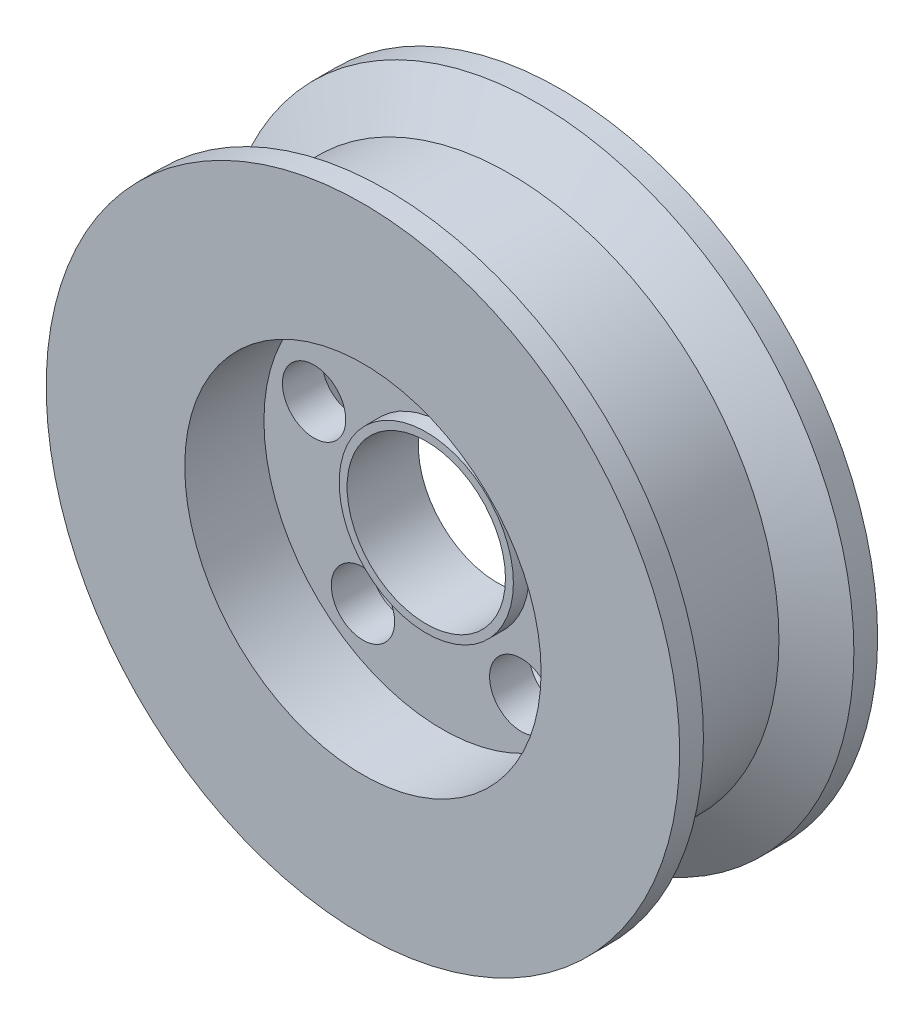
ISO-10303-21;
HEADER;
FILE_DESCRIPTION(('STEP AP214'),'2;1');
FILE_NAME('part.step','',(''),(''),'','','');
FILE_SCHEMA(('AUTOMOTIVE_DESIGN { 1 0 10303 214 1 1 1 1 }'));
ENDSEC;
DATA;
#1=APPLICATION_CONTEXT('core data for automotive mechanical design processes');
#2=APPLICATION_PROTOCOL_DEFINITION('international standard','automotive_design',2000,#1);
#3=PRODUCT_CONTEXT('',#1,'mechanical');
#4=PRODUCT('Part','Part','',(#3));
#5=PRODUCT_RELATED_PRODUCT_CATEGORY('part','',(#4));
#6=PRODUCT_DEFINITION_FORMATION('','',#4);
#7=PRODUCT_DEFINITION_CONTEXT('part definition',#1,'design');
#8=PRODUCT_DEFINITION('design','',#6,#7);
#9=PRODUCT_DEFINITION_SHAPE('','',#8);
#10=(LENGTH_UNIT() NAMED_UNIT(*) SI_UNIT(.MILLI.,.METRE.));
#11=(NAMED_UNIT(*) PLANE_ANGLE_UNIT() SI_UNIT($,.RADIAN.));
#12=(NAMED_UNIT(*) SI_UNIT($,.STERADIAN.) SOLID_ANGLE_UNIT());
#13=UNCERTAINTY_MEASURE_WITH_UNIT(LENGTH_MEASURE(1.E-05),#10,'distance_accuracy_value','');
#14=(GEOMETRIC_REPRESENTATION_CONTEXT(3) GLOBAL_UNCERTAINTY_ASSIGNED_CONTEXT((#13)) GLOBAL_UNIT_ASSIGNED_CONTEXT((#10,
#11,#12)) REPRESENTATION_CONTEXT('',''));
#15=CARTESIAN_POINT('',(0.,0.,0.));
#16=DIRECTION('',(0.,0.,1.));
#17=DIRECTION('',(1.,0.,0.));
#18=AXIS2_PLACEMENT_3D('',#15,#16,#17);
#19=CARTESIAN_POINT('',(0.,0.,12.5));
#20=DIRECTION('',(0.,0.,-1.));
#21=DIRECTION('',(-1.,0.,0.));
#22=AXIS2_PLACEMENT_3D('',#19,#20,#21);
#23=CYLINDRICAL_SURFACE('',#22,40.);
#24=CARTESIAN_POINT('',(0.,0.,-12.5));
#25=DIRECTION('',(0.,0.,1.));
#26=DIRECTION('',(1.,0.,0.));
#27=AXIS2_PLACEMENT_3D('',#24,#25,#26);
#28=CIRCLE('',#27,40.);
#29=CARTESIAN_POINT('',(40.,0.,-12.5));
#30=VERTEX_POINT('',#29);
#31=EDGE_CURVE('E75',#30,#30,#28,.T.);
#32=ORIENTED_EDGE('',*,*,#31,.T.);
#33=EDGE_LOOP('',(#32));
#34=FACE_BOUND('',#33,.T.);
#35=CARTESIAN_POINT('',(0.,0.,-9.5));
#36=DIRECTION('',(0.,0.,1.));
#37=DIRECTION('',(1.,0.,0.));
#38=AXIS2_PLACEMENT_3D('',#35,#36,#37);
#39=CIRCLE('',#38,40.);
#40=CARTESIAN_POINT('',(40.,0.,-9.5));
#41=VERTEX_POINT('',#40);
#42=EDGE_CURVE('E132',#41,#41,#39,.T.);
#43=ORIENTED_EDGE('',*,*,#42,.F.);
#44=EDGE_LOOP('',(#43));
#45=FACE_BOUND('',#44,.T.);
#46=ADVANCED_FACE('F31',(#34,#45),#23,.T.);
#47=CARTESIAN_POINT('',(0.,0.,12.5));
#48=DIRECTION('',(0.,0.,1.));
#49=DIRECTION('',(1.,0.,0.));
#50=AXIS2_PLACEMENT_3D('',#47,#48,#49);
#51=CIRCLE('',#50,40.);
#52=CARTESIAN_POINT('',(40.,0.,12.5));
#53=VERTEX_POINT('',#52);
#54=EDGE_CURVE('E42',#53,#53,#51,.T.);
#55=ORIENTED_EDGE('',*,*,#54,.F.);
#56=EDGE_LOOP('',(#55));
#57=FACE_BOUND('',#56,.T.);
#58=CARTESIAN_POINT('',(0.,0.,9.5));
#59=DIRECTION('',(0.,0.,1.));
#60=DIRECTION('',(1.,0.,0.));
#61=AXIS2_PLACEMENT_3D('',#58,#59,#60);
#62=CIRCLE('',#61,40.);
#63=CARTESIAN_POINT('',(40.,0.,9.5));
#64=VERTEX_POINT('',#63);
#65=EDGE_CURVE('E135',#64,#64,#62,.T.);
#66=ORIENTED_EDGE('',*,*,#65,.T.);
#67=EDGE_LOOP('',(#66));
#68=FACE_BOUND('',#67,.T.);
#69=ADVANCED_FACE('F129',(#57,#68),#23,.T.);
#70=CARTESIAN_POINT('',(0.,0.,12.5));
#71=DIRECTION('',(0.,0.,1.));
#72=DIRECTION('',(1.,0.,0.));
#73=AXIS2_PLACEMENT_3D('',#70,#71,#72);
#74=PLANE('',#73);
#75=CARTESIAN_POINT('',(0.,0.,12.5));
#76=DIRECTION('',(0.,0.,1.));
#77=DIRECTION('',(1.,0.,0.));
#78=AXIS2_PLACEMENT_3D('',#75,#76,#77);
#79=CIRCLE('',#78,22.5);
#80=CARTESIAN_POINT('',(22.5,0.,12.5));
#81=VERTEX_POINT('',#80);
#82=EDGE_CURVE('E68',#81,#81,#79,.T.);
#83=ORIENTED_EDGE('',*,*,#82,.F.);
#84=EDGE_LOOP('',(#83));
#85=FACE_BOUND('',#84,.T.);
#86=ORIENTED_EDGE('',*,*,#54,.T.);
#87=EDGE_LOOP('',(#86));
#88=FACE_BOUND('',#87,.T.);
#89=ADVANCED_FACE('F124',(#85,#88),#74,.T.);
#90=CARTESIAN_POINT('',(0.,0.,-12.5));
#91=DIRECTION('',(0.,0.,1.));
#92=DIRECTION('',(1.,0.,0.));
#93=AXIS2_PLACEMENT_3D('',#90,#91,#92);
#94=PLANE('',#93);
#95=CARTESIAN_POINT('',(0.,0.,-12.5));
#96=DIRECTION('',(0.,0.,1.));
#97=DIRECTION('',(1.,0.,0.));
#98=AXIS2_PLACEMENT_3D('',#95,#96,#97);
#99=CIRCLE('',#98,22.5);
#100=CARTESIAN_POINT('',(22.5,0.,-12.5));
#101=VERTEX_POINT('',#100);
#102=EDGE_CURVE('E69',#101,#101,#99,.T.);
#103=ORIENTED_EDGE('',*,*,#102,.T.);
#104=EDGE_LOOP('',(#103));
#105=FACE_BOUND('',#104,.T.);
#106=ORIENTED_EDGE('',*,*,#31,.F.);
#107=EDGE_LOOP('',(#106));
#108=FACE_BOUND('',#107,.T.);
#109=ADVANCED_FACE('F120',(#105,#108),#94,.F.);
#110=CARTESIAN_POINT('',(0.,0.,2.5));
#111=DIRECTION('',(0.,0.,1.));
#112=DIRECTION('',(1.,0.,0.));
#113=AXIS2_PLACEMENT_3D('',#110,#111,#112);
#114=CYLINDRICAL_SURFACE('',#113,22.5);
#115=CARTESIAN_POINT('',(0.,0.,2.5));
#116=DIRECTION('',(0.,0.,1.));
#117=DIRECTION('',(1.,0.,0.));
#118=AXIS2_PLACEMENT_3D('',#115,#116,#117);
#119=CIRCLE('',#118,22.5);
#120=CARTESIAN_POINT('',(22.5,0.,2.5));
#121=VERTEX_POINT('',#120);
#122=EDGE_CURVE('E72',#121,#121,#119,.T.);
#123=ORIENTED_EDGE('',*,*,#122,.F.);
#124=EDGE_LOOP('',(#123));
#125=FACE_BOUND('',#124,.T.);
#126=ORIENTED_EDGE('',*,*,#82,.T.);
#127=EDGE_LOOP('',(#126));
#128=FACE_BOUND('',#127,.T.);
#129=ADVANCED_FACE('F123',(#125,#128),#114,.F.);
#130=CARTESIAN_POINT('',(0.,0.,2.5));
#131=DIRECTION('',(0.,0.,1.));
#132=DIRECTION('',(1.,0.,0.));
#133=AXIS2_PLACEMENT_3D('',#130,#131,#132);
#134=PLANE('',#133);
#135=CARTESIAN_POINT('',(0.,0.,2.5));
#136=DIRECTION('',(0.,0.,1.));
#137=DIRECTION('',(1.,0.,0.));
#138=AXIS2_PLACEMENT_3D('',#135,#136,#137);
#139=CIRCLE('',#138,11.);
#140=CARTESIAN_POINT('',(11.,0.,2.5));
#141=VERTEX_POINT('',#140);
#142=EDGE_CURVE('E10',#141,#141,#139,.T.);
#143=ORIENTED_EDGE('',*,*,#142,.F.);
#144=EDGE_LOOP('',(#143));
#145=FACE_BOUND('',#144,.T.);
#146=CARTESIAN_POINT('',(-16.1679607770176,5.25328890437429,2.5));
#147=DIRECTION('',(0.,0.,1.));
#148=DIRECTION('',(0.309016994374958,0.95105651629515,0.));
#149=AXIS2_PLACEMENT_3D('',#146,#147,#148);
#150=CIRCLE('',#149,4.);
#151=CARTESIAN_POINT('',(-14.9318927995177,9.05751496955489,2.5));
#152=VERTEX_POINT('',#151);
#153=EDGE_CURVE('E54',#152,#152,#150,.T.);
#154=ORIENTED_EDGE('',*,*,#153,.F.);
#155=EDGE_LOOP('',(#154));
#156=FACE_BOUND('',#155,.T.);
#157=CARTESIAN_POINT('',(-9.99234928897216,-13.753288904374,2.5));
#158=DIRECTION('',(0.,0.,1.));
#159=DIRECTION('',(-0.809016994374942,0.58778525229248,0.));
#160=AXIS2_PLACEMENT_3D('',#157,#158,#159);
#161=CIRCLE('',#160,4.);
#162=CARTESIAN_POINT('',(-13.2284172664719,-11.4021478952041,2.5));
#163=VERTEX_POINT('',#162);
#164=EDGE_CURVE('E51',#163,#163,#161,.T.);
#165=ORIENTED_EDGE('',*,*,#164,.F.);
#166=EDGE_LOOP('',(#165));
#167=FACE_BOUND('',#166,.T.);
#168=CARTESIAN_POINT('',(9.99234928897197,-13.7532889043742,2.5));
#169=DIRECTION('',(0.,0.,1.));
#170=DIRECTION('',(-0.809016994374951,-0.587785252292469,0.));
#171=AXIS2_PLACEMENT_3D('',#168,#169,#170);
#172=CIRCLE('',#171,4.);
#173=CARTESIAN_POINT('',(6.75628131147216,-16.104429913544,2.5));
#174=VERTEX_POINT('',#173);
#175=EDGE_CURVE('E47',#174,#174,#172,.T.);
#176=ORIENTED_EDGE('',*,*,#175,.F.);
#177=EDGE_LOOP('',(#176));
#178=FACE_BOUND('',#177,.T.);
#179=CARTESIAN_POINT('',(16.1679607770176,5.25328890437406,2.5));
#180=DIRECTION('',(0.,0.,1.));
#181=DIRECTION('',(0.309016994374945,-0.951056516295155,0.));
#182=AXIS2_PLACEMENT_3D('',#179,#180,#181);
#183=CIRCLE('',#182,4.);
#184=CARTESIAN_POINT('',(17.4040287545174,1.44906283919344,2.5));
#185=VERTEX_POINT('',#184);
#186=EDGE_CURVE('E50',#185,#185,#183,.T.);
#187=ORIENTED_EDGE('',*,*,#186,.F.);
#188=EDGE_LOOP('',(#187));
#189=FACE_BOUND('',#188,.T.);
#190=CARTESIAN_POINT('',(0.,17.,2.5));
#191=DIRECTION('',(0.,0.,1.));
#192=DIRECTION('',(1.,0.,0.));
#193=AXIS2_PLACEMENT_3D('',#190,#191,#192);
#194=CIRCLE('',#193,4.);
#195=CARTESIAN_POINT('',(4.,17.,2.5));
#196=VERTEX_POINT('',#195);
#197=EDGE_CURVE('E60',#196,#196,#194,.T.);
#198=ORIENTED_EDGE('',*,*,#197,.F.);
#199=EDGE_LOOP('',(#198));
#200=FACE_BOUND('',#199,.T.);
#201=ORIENTED_EDGE('',*,*,#122,.T.);
#202=EDGE_LOOP('',(#201));
#203=FACE_BOUND('',#202,.T.);
#204=ADVANCED_FACE('F116',(#145,#156,#167,#178,#189,#200,#203),#134,.T.);
#205=CARTESIAN_POINT('',(0.,0.,-2.5));
#206=DIRECTION('',(0.,0.,-1.));
#207=DIRECTION('',(-1.,0.,0.));
#208=AXIS2_PLACEMENT_3D('',#205,#206,#207);
#209=CYLINDRICAL_SURFACE('',#208,22.5);
#210=CARTESIAN_POINT('',(0.,0.,-2.5));
#211=DIRECTION('',(0.,0.,1.));
#212=DIRECTION('',(1.,0.,0.));
#213=AXIS2_PLACEMENT_3D('',#210,#211,#212);
#214=CIRCLE('',#213,22.5);
#215=CARTESIAN_POINT('',(22.5,0.,-2.5));
#216=VERTEX_POINT('',#215);
#217=EDGE_CURVE('E65',#216,#216,#214,.T.);
#218=ORIENTED_EDGE('',*,*,#217,.T.);
#219=EDGE_LOOP('',(#218));
#220=FACE_BOUND('',#219,.T.);
#221=ORIENTED_EDGE('',*,*,#102,.F.);
#222=EDGE_LOOP('',(#221));
#223=FACE_BOUND('',#222,.T.);
#224=ADVANCED_FACE('F101',(#220,#223),#209,.F.);
#225=CARTESIAN_POINT('',(0.,0.,-2.5));
#226=DIRECTION('',(0.,0.,-1.));
#227=DIRECTION('',(1.,0.,0.));
#228=AXIS2_PLACEMENT_3D('',#225,#226,#227);
#229=PLANE('',#228);
#230=CARTESIAN_POINT('',(0.,0.,-2.5));
#231=DIRECTION('',(0.,0.,-1.));
#232=DIRECTION('',(-1.,0.,0.));
#233=AXIS2_PLACEMENT_3D('',#230,#231,#232);
#234=CIRCLE('',#233,11.);
#235=CARTESIAN_POINT('',(-11.,0.,-2.5));
#236=VERTEX_POINT('',#235);
#237=EDGE_CURVE('E34',#236,#236,#234,.T.);
#238=ORIENTED_EDGE('',*,*,#237,.F.);
#239=EDGE_LOOP('',(#238));
#240=FACE_BOUND('',#239,.T.);
#241=CARTESIAN_POINT('',(-16.1679607770176,5.25328890437429,-2.5));
#242=DIRECTION('',(0.,0.,-1.));
#243=DIRECTION('',(-1.,0.,0.));
#244=AXIS2_PLACEMENT_3D('',#241,#242,#243);
#245=CIRCLE('',#244,4.);
#246=CARTESIAN_POINT('',(-20.1679607770176,5.25328890437429,-2.5));
#247=VERTEX_POINT('',#246);
#248=EDGE_CURVE('E64',#247,#247,#245,.T.);
#249=ORIENTED_EDGE('',*,*,#248,.F.);
#250=EDGE_LOOP('',(#249));
#251=FACE_BOUND('',#250,.T.);
#252=CARTESIAN_POINT('',(-9.99234928897216,-13.753288904374,-2.5));
#253=DIRECTION('',(0.,0.,-1.));
#254=DIRECTION('',(-1.,0.,0.));
#255=AXIS2_PLACEMENT_3D('',#252,#253,#254);
#256=CIRCLE('',#255,4.);
#257=CARTESIAN_POINT('',(-13.9923492889722,-13.753288904374,-2.5));
#258=VERTEX_POINT('',#257);
#259=EDGE_CURVE('E89',#258,#258,#256,.T.);
#260=ORIENTED_EDGE('',*,*,#259,.F.);
#261=EDGE_LOOP('',(#260));
#262=FACE_BOUND('',#261,.T.);
#263=CARTESIAN_POINT('',(9.99234928897197,-13.7532889043742,-2.5));
#264=DIRECTION('',(0.,0.,-1.));
#265=DIRECTION('',(-1.,0.,0.));
#266=AXIS2_PLACEMENT_3D('',#263,#264,#265);
#267=CIRCLE('',#266,4.);
#268=CARTESIAN_POINT('',(5.99234928897197,-13.7532889043742,-2.5));
#269=VERTEX_POINT('',#268);
#270=EDGE_CURVE('E86',#269,#269,#267,.T.);
#271=ORIENTED_EDGE('',*,*,#270,.F.);
#272=EDGE_LOOP('',(#271));
#273=FACE_BOUND('',#272,.T.);
#274=CARTESIAN_POINT('',(16.1679607770176,5.25328890437406,-2.5));
#275=DIRECTION('',(0.,0.,-1.));
#276=DIRECTION('',(-1.,0.,0.));
#277=AXIS2_PLACEMENT_3D('',#274,#275,#276);
#278=CIRCLE('',#277,4.);
#279=CARTESIAN_POINT('',(12.1679607770176,5.25328890437406,-2.5));
#280=VERTEX_POINT('',#279);
#281=EDGE_CURVE('E59',#280,#280,#278,.T.);
#282=ORIENTED_EDGE('',*,*,#281,.F.);
#283=EDGE_LOOP('',(#282));
#284=FACE_BOUND('',#283,.T.);
#285=CARTESIAN_POINT('',(0.,17.,-2.5));
#286=DIRECTION('',(0.,0.,-1.));
#287=DIRECTION('',(-1.,0.,0.));
#288=AXIS2_PLACEMENT_3D('',#285,#286,#287);
#289=CIRCLE('',#288,4.);
#290=CARTESIAN_POINT('',(-4.,17.,-2.5));
#291=VERTEX_POINT('',#290);
#292=EDGE_CURVE('E63',#291,#291,#289,.T.);
#293=ORIENTED_EDGE('',*,*,#292,.F.);
#294=EDGE_LOOP('',(#293));
#295=FACE_BOUND('',#294,.T.);
#296=ORIENTED_EDGE('',*,*,#217,.F.);
#297=EDGE_LOOP('',(#296));
#298=FACE_BOUND('',#297,.T.);
#299=ADVANCED_FACE('F97',(#240,#251,#262,#273,#284,#295,#298),#229,.T.);
#300=CARTESIAN_POINT('',(0.,17.,-12.5));
#301=DIRECTION('',(0.,0.,1.));
#302=DIRECTION('',(1.,0.,0.));
#303=AXIS2_PLACEMENT_3D('',#300,#301,#302);
#304=CYLINDRICAL_SURFACE('',#303,4.);
#305=ORIENTED_EDGE('',*,*,#292,.T.);
#306=EDGE_LOOP('',(#305));
#307=FACE_BOUND('',#306,.T.);
#308=ORIENTED_EDGE('',*,*,#197,.T.);
#309=EDGE_LOOP('',(#308));
#310=FACE_BOUND('',#309,.T.);
#311=ADVANCED_FACE('F100',(#307,#310),#304,.F.);
#312=CARTESIAN_POINT('',(16.1679607770176,5.25328890437406,-12.5));
#313=DIRECTION('',(0.,0.,1.));
#314=DIRECTION('',(1.,0.,0.));
#315=AXIS2_PLACEMENT_3D('',#312,#313,#314);
#316=CYLINDRICAL_SURFACE('',#315,4.);
#317=ORIENTED_EDGE('',*,*,#281,.T.);
#318=EDGE_LOOP('',(#317));
#319=FACE_BOUND('',#318,.T.);
#320=ORIENTED_EDGE('',*,*,#186,.T.);
#321=EDGE_LOOP('',(#320));
#322=FACE_BOUND('',#321,.T.);
#323=ADVANCED_FACE('F173',(#319,#322),#316,.F.);
#324=CARTESIAN_POINT('',(9.99234928897197,-13.7532889043742,-12.5));
#325=DIRECTION('',(0.,0.,1.));
#326=DIRECTION('',(1.,0.,0.));
#327=AXIS2_PLACEMENT_3D('',#324,#325,#326);
#328=CYLINDRICAL_SURFACE('',#327,4.);
#329=ORIENTED_EDGE('',*,*,#270,.T.);
#330=EDGE_LOOP('',(#329));
#331=FACE_BOUND('',#330,.T.);
#332=ORIENTED_EDGE('',*,*,#175,.T.);
#333=EDGE_LOOP('',(#332));
#334=FACE_BOUND('',#333,.T.);
#335=ADVANCED_FACE('F169',(#331,#334),#328,.F.);
#336=CARTESIAN_POINT('',(-9.99234928897216,-13.753288904374,-12.5));
#337=DIRECTION('',(0.,0.,1.));
#338=DIRECTION('',(1.,0.,0.));
#339=AXIS2_PLACEMENT_3D('',#336,#337,#338);
#340=CYLINDRICAL_SURFACE('',#339,4.);
#341=ORIENTED_EDGE('',*,*,#259,.T.);
#342=EDGE_LOOP('',(#341));
#343=FACE_BOUND('',#342,.T.);
#344=ORIENTED_EDGE('',*,*,#164,.T.);
#345=EDGE_LOOP('',(#344));
#346=FACE_BOUND('',#345,.T.);
#347=ADVANCED_FACE('F172',(#343,#346),#340,.F.);
#348=CARTESIAN_POINT('',(-16.1679607770176,5.25328890437429,-12.5));
#349=DIRECTION('',(0.,0.,1.));
#350=DIRECTION('',(1.,0.,0.));
#351=AXIS2_PLACEMENT_3D('',#348,#349,#350);
#352=CYLINDRICAL_SURFACE('',#351,4.);
#353=ORIENTED_EDGE('',*,*,#248,.T.);
#354=EDGE_LOOP('',(#353));
#355=FACE_BOUND('',#354,.T.);
#356=ORIENTED_EDGE('',*,*,#153,.T.);
#357=EDGE_LOOP('',(#356));
#358=FACE_BOUND('',#357,.T.);
#359=ADVANCED_FACE('F94',(#355,#358),#352,.F.);
#360=CARTESIAN_POINT('',(0.,0.,-4.5));
#361=DIRECTION('',(0.,0.,1.));
#362=DIRECTION('',(1.,0.,0.));
#363=AXIS2_PLACEMENT_3D('',#360,#361,#362);
#364=CYLINDRICAL_SURFACE('',#363,11.);
#365=ORIENTED_EDGE('',*,*,#237,.T.);
#366=EDGE_LOOP('',(#365));
#367=FACE_BOUND('',#366,.T.);
#368=CARTESIAN_POINT('',(0.,0.,-4.5));
#369=DIRECTION('',(0.,0.,1.));
#370=DIRECTION('',(1.,0.,0.));
#371=AXIS2_PLACEMENT_3D('',#368,#369,#370);
#372=CIRCLE('',#371,11.);
#373=CARTESIAN_POINT('',(11.,0.,-4.5));
#374=VERTEX_POINT('',#373);
#375=EDGE_CURVE('E45',#374,#374,#372,.T.);
#376=ORIENTED_EDGE('',*,*,#375,.T.);
#377=EDGE_LOOP('',(#376));
#378=FACE_BOUND('',#377,.T.);
#379=ADVANCED_FACE('F153',(#367,#378),#364,.T.);
#380=CARTESIAN_POINT('',(0.,0.,-4.5));
#381=DIRECTION('',(0.,0.,1.));
#382=DIRECTION('',(1.,0.,0.));
#383=AXIS2_PLACEMENT_3D('',#380,#381,#382);
#384=PLANE('',#383);
#385=CARTESIAN_POINT('',(0.,0.,-4.5));
#386=DIRECTION('',(0.,0.,1.));
#387=DIRECTION('',(1.,0.,0.));
#388=AXIS2_PLACEMENT_3D('',#385,#386,#387);
#389=CIRCLE('',#388,10.);
#390=CARTESIAN_POINT('',(10.,0.,-4.5));
#391=VERTEX_POINT('',#390);
#392=EDGE_CURVE('E146',#391,#391,#389,.T.);
#393=ORIENTED_EDGE('',*,*,#392,.T.);
#394=EDGE_LOOP('',(#393));
#395=FACE_BOUND('',#394,.T.);
#396=ORIENTED_EDGE('',*,*,#375,.F.);
#397=EDGE_LOOP('',(#396));
#398=FACE_BOUND('',#397,.T.);
#399=ADVANCED_FACE('F155',(#395,#398),#384,.F.);
#400=ORIENTED_EDGE('',*,*,#142,.T.);
#401=EDGE_LOOP('',(#400));
#402=FACE_BOUND('',#401,.T.);
#403=CARTESIAN_POINT('',(0.,0.,4.5));
#404=DIRECTION('',(0.,0.,1.));
#405=DIRECTION('',(1.,0.,0.));
#406=AXIS2_PLACEMENT_3D('',#403,#404,#405);
#407=CIRCLE('',#406,11.);
#408=CARTESIAN_POINT('',(11.,0.,4.5));
#409=VERTEX_POINT('',#408);
#410=EDGE_CURVE('E138',#409,#409,#407,.T.);
#411=ORIENTED_EDGE('',*,*,#410,.F.);
#412=EDGE_LOOP('',(#411));
#413=FACE_BOUND('',#412,.T.);
#414=ADVANCED_FACE('F157',(#402,#413),#364,.T.);
#415=CARTESIAN_POINT('',(0.,0.,4.5));
#416=DIRECTION('',(0.,0.,1.));
#417=DIRECTION('',(1.,0.,0.));
#418=AXIS2_PLACEMENT_3D('',#415,#416,#417);
#419=PLANE('',#418);
#420=ORIENTED_EDGE('',*,*,#410,.T.);
#421=EDGE_LOOP('',(#420));
#422=FACE_BOUND('',#421,.T.);
#423=CARTESIAN_POINT('',(0.,0.,4.5));
#424=DIRECTION('',(0.,0.,1.));
#425=DIRECTION('',(1.,0.,0.));
#426=AXIS2_PLACEMENT_3D('',#423,#424,#425);
#427=CIRCLE('',#426,10.);
#428=CARTESIAN_POINT('',(10.,0.,4.5));
#429=VERTEX_POINT('',#428);
#430=EDGE_CURVE('E134',#429,#429,#427,.T.);
#431=ORIENTED_EDGE('',*,*,#430,.F.);
#432=EDGE_LOOP('',(#431));
#433=FACE_BOUND('',#432,.T.);
#434=ADVANCED_FACE('F163',(#422,#433),#419,.T.);
#435=CARTESIAN_POINT('',(0.,0.,12.5));
#436=DIRECTION('',(0.,0.,-1.));
#437=DIRECTION('',(-1.,0.,0.));
#438=AXIS2_PLACEMENT_3D('',#435,#436,#437);
#439=CYLINDRICAL_SURFACE('',#438,10.);
#440=ORIENTED_EDGE('',*,*,#392,.F.);
#441=EDGE_LOOP('',(#440));
#442=FACE_BOUND('',#441,.T.);
#443=ORIENTED_EDGE('',*,*,#430,.T.);
#444=EDGE_LOOP('',(#443));
#445=FACE_BOUND('',#444,.T.);
#446=ADVANCED_FACE('F192',(#442,#445),#439,.F.);
#447=CARTESIAN_POINT('',(0.,0.,-6.03589838486221));
#448=DIRECTION('',(0.,0.,-1.));
#449=DIRECTION('',(-1.,0.,0.));
#450=AXIS2_PLACEMENT_3D('',#447,#448,#449);
#451=CONICAL_SURFACE('',#450,34.,1.04719755119659);
#452=ORIENTED_EDGE('',*,*,#42,.T.);
#453=EDGE_LOOP('',(#452));
#454=FACE_BOUND('',#453,.T.);
#455=CARTESIAN_POINT('',(0.,0.,-6.03589838486221));
#456=DIRECTION('',(0.,0.,1.));
#457=DIRECTION('',(1.,0.,0.));
#458=AXIS2_PLACEMENT_3D('',#455,#456,#457);
#459=CIRCLE('',#458,34.);
#460=CARTESIAN_POINT('',(34.,0.,-6.03589838486221));
#461=VERTEX_POINT('',#460);
#462=EDGE_CURVE('E223',#461,#461,#459,.T.);
#463=ORIENTED_EDGE('',*,*,#462,.F.);
#464=EDGE_LOOP('',(#463));
#465=FACE_BOUND('',#464,.T.);
#466=ADVANCED_FACE('F195',(#454,#465),#451,.T.);
#467=CARTESIAN_POINT('',(0.,0.,9.5));
#468=DIRECTION('',(0.,0.,1.));
#469=DIRECTION('',(1.,0.,0.));
#470=AXIS2_PLACEMENT_3D('',#467,#468,#469);
#471=CONICAL_SURFACE('',#470,40.,1.04722107680625);
#472=CARTESIAN_POINT('',(0.,0.,6.03608658718328));
#473=DIRECTION('',(0.,0.,1.));
#474=DIRECTION('',(1.,0.,0.));
#475=AXIS2_PLACEMENT_3D('',#472,#473,#474);
#476=CIRCLE('',#475,34.);
#477=CARTESIAN_POINT('',(34.,0.,6.03608658718328));
#478=VERTEX_POINT('',#477);
#479=EDGE_CURVE('E141',#478,#478,#476,.T.);
#480=ORIENTED_EDGE('',*,*,#479,.T.);
#481=EDGE_LOOP('',(#480));
#482=FACE_BOUND('',#481,.T.);
#483=ORIENTED_EDGE('',*,*,#65,.F.);
#484=EDGE_LOOP('',(#483));
#485=FACE_BOUND('',#484,.T.);
#486=ADVANCED_FACE('F209',(#482,#485),#471,.T.);
#487=CARTESIAN_POINT('',(0.,0.,0.));
#488=DIRECTION('',(0.,0.,1.));
#489=DIRECTION('',(1.,0.,0.));
#490=AXIS2_PLACEMENT_3D('',#487,#488,#489);
#491=CYLINDRICAL_SURFACE('',#490,34.);
#492=ORIENTED_EDGE('',*,*,#462,.T.);
#493=EDGE_LOOP('',(#492));
#494=FACE_BOUND('',#493,.T.);
#495=ORIENTED_EDGE('',*,*,#479,.F.);
#496=EDGE_LOOP('',(#495));
#497=FACE_BOUND('',#496,.T.);
#498=ADVANCED_FACE('F211',(#494,#497),#491,.T.);
#499=CLOSED_SHELL('',(#46,#69,#89,#109,#129,#204,#224,#299,#311,#323,#335,#347,#359,#379,#399,
#414,#434,#446,#466,#486,#498));
#500=MANIFOLD_SOLID_BREP('B2',#499);
#501=ADVANCED_BREP_SHAPE_REPRESENTATION('',(#18,#500),#14);
#502=SHAPE_DEFINITION_REPRESENTATION(#9,#501);
ENDSEC;
END-ISO-10303-21;
